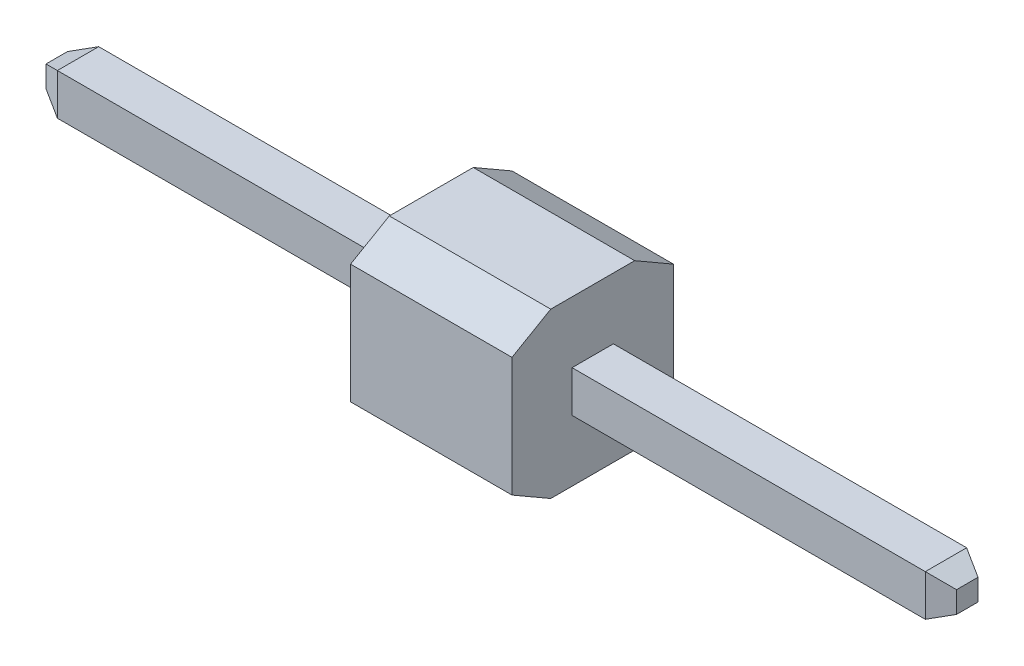
ISO-10303-21;
HEADER;
FILE_DESCRIPTION(('STEP AP214'),'2;1');
FILE_NAME('part.step','',(''),(''),'','','');
FILE_SCHEMA(('AUTOMOTIVE_DESIGN { 1 0 10303 214 1 1 1 1 }'));
ENDSEC;
DATA;
#1=APPLICATION_CONTEXT('core data for automotive mechanical design processes');
#2=APPLICATION_PROTOCOL_DEFINITION('international standard','automotive_design',2000,#1);
#3=PRODUCT_CONTEXT('',#1,'mechanical');
#4=PRODUCT('Part','Part','',(#3));
#5=PRODUCT_RELATED_PRODUCT_CATEGORY('part','',(#4));
#6=PRODUCT_DEFINITION_FORMATION('','',#4);
#7=PRODUCT_DEFINITION_CONTEXT('part definition',#1,'design');
#8=PRODUCT_DEFINITION('design','',#6,#7);
#9=PRODUCT_DEFINITION_SHAPE('','',#8);
#10=(LENGTH_UNIT() NAMED_UNIT(*) SI_UNIT(.MILLI.,.METRE.));
#11=(NAMED_UNIT(*) PLANE_ANGLE_UNIT() SI_UNIT($,.RADIAN.));
#12=(NAMED_UNIT(*) SI_UNIT($,.STERADIAN.) SOLID_ANGLE_UNIT());
#13=UNCERTAINTY_MEASURE_WITH_UNIT(LENGTH_MEASURE(1.E-05),#10,'distance_accuracy_value','');
#14=(GEOMETRIC_REPRESENTATION_CONTEXT(3) GLOBAL_UNCERTAINTY_ASSIGNED_CONTEXT((#13)) GLOBAL_UNIT_ASSIGNED_CONTEXT((#10,
#11,#12)) REPRESENTATION_CONTEXT('',''));
#15=CARTESIAN_POINT('',(0.,0.,0.));
#16=DIRECTION('',(0.,0.,1.));
#17=DIRECTION('',(1.,0.,0.));
#18=AXIS2_PLACEMENT_3D('',#15,#16,#17);
#19=CARTESIAN_POINT('',(5.42105048309456,-7.93712826291391,0.629998634255617));
#20=DIRECTION('',(1.,4.37113882867379E-08,-4.37113882867379E-08));
#21=DIRECTION('',(-4.37113882867379E-08,1.,0.));
#22=AXIS2_PLACEMENT_3D('',#19,#20,#21);
#23=PLANE('',#22);
#24=DIRECTION('',(1.59994777304463E-08,0.50000000000019,0.866025403784329));
#25=VECTOR('',#24,1.);
#26=CARTESIAN_POINT('',(5.42105036010864,-6.69353842442392,-0.940001365744382));
#27=LINE('',#26,#25);
#28=CARTESIAN_POINT('',(5.42105036010864,-6.69353842442392,-0.940001365744382));
#29=VERTEX_POINT('',#28);
#30=CARTESIAN_POINT('',(5.42105037119341,-6.34712826291392,-0.340001365744383));
#31=VERTEX_POINT('',#30);
#32=EDGE_CURVE('E11',#29,#31,#27,.T.);
#33=ORIENTED_EDGE('',*,*,#32,.T.);
#34=DIRECTION('',(4.37113886966664E-08,0.,0.999999999999999));
#35=VECTOR('',#34,1.);
#36=CARTESIAN_POINT('',(5.42105037119341,-6.34712826291392,-0.340001365744383));
#37=LINE('',#36,#35);
#38=CARTESIAN_POINT('',(5.42105042801821,-6.34712826291391,0.959998634255618));
#39=VERTEX_POINT('',#38);
#40=EDGE_CURVE('E304',#31,#39,#37,.T.);
#41=ORIENTED_EDGE('',*,*,#40,.T.);
#42=DIRECTION('',(5.97108668825761E-08,-0.500000000000186,0.86602540378433));
#43=VECTOR('',#42,1.);
#44=CARTESIAN_POINT('',(5.42105042801821,-6.34712826291391,0.959998634255618));
#45=LINE('',#44,#43);
#46=CARTESIAN_POINT('',(5.42105046938711,-6.69353842442391,1.55999863425562));
#47=VERTEX_POINT('',#46);
#48=EDGE_CURVE('E296',#39,#47,#45,.T.);
#49=ORIENTED_EDGE('',*,*,#48,.T.);
#50=DIRECTION('',(4.37113884815544E-08,-0.999999999999999,0.));
#51=VECTOR('',#50,1.);
#52=CARTESIAN_POINT('',(5.42105046938711,-6.69353842442391,1.55999863425562));
#53=LINE('',#52,#51);
#54=CARTESIAN_POINT('',(5.4210505501299,-8.54071810139391,1.55999863425562));
#55=VERTEX_POINT('',#54);
#56=EDGE_CURVE('E281',#47,#55,#53,.T.);
#57=ORIENTED_EDGE('',*,*,#56,.T.);
#58=DIRECTION('',(1.5999479012306E-08,0.500000000000192,0.866025403784328));
#59=VECTOR('',#58,1.);
#60=CARTESIAN_POINT('',(5.42105053904514,-8.88712826291391,0.959998634255618));
#61=LINE('',#60,#59);
#62=CARTESIAN_POINT('',(5.42105053904514,-8.88712826291391,0.959998634255618));
#63=VERTEX_POINT('',#62);
#64=EDGE_CURVE('E265',#63,#55,#61,.T.);
#65=ORIENTED_EDGE('',*,*,#64,.F.);
#66=DIRECTION('',(4.37113886966664E-08,0.,0.999999999999999));
#67=VECTOR('',#66,1.);
#68=CARTESIAN_POINT('',(5.42105048222033,-8.88712826291392,-0.340001365744383));
#69=LINE('',#68,#67);
#70=CARTESIAN_POINT('',(5.42105048222033,-8.88712826291392,-0.340001365744383));
#71=VERTEX_POINT('',#70);
#72=EDGE_CURVE('E248',#71,#63,#69,.T.);
#73=ORIENTED_EDGE('',*,*,#72,.F.);
#74=DIRECTION('',(5.97108656001701E-08,-0.500000000000187,0.866025403784328));
#75=VECTOR('',#74,1.);
#76=CARTESIAN_POINT('',(5.42105044085143,-8.54071810139392,-0.940001365744382));
#77=LINE('',#76,#75);
#78=CARTESIAN_POINT('',(5.42105044085143,-8.54071810139392,-0.940001365744382));
#79=VERTEX_POINT('',#78);
#80=EDGE_CURVE('E242',#79,#71,#77,.T.);
#81=ORIENTED_EDGE('',*,*,#80,.F.);
#82=DIRECTION('',(4.37113884815544E-08,-0.999999999999999,0.));
#83=VECTOR('',#82,1.);
#84=CARTESIAN_POINT('',(5.42105036010864,-6.69353842442392,-0.940001365744382));
#85=LINE('',#84,#83);
#86=EDGE_CURVE('E236',#29,#79,#85,.T.);
#87=ORIENTED_EDGE('',*,*,#86,.F.);
#88=EDGE_LOOP('',(#33,#41,#49,#57,#65,#73,#81,#87));
#89=FACE_BOUND('',#88,.T.);
#90=DIRECTION('',(-4.37113872875372E-08,0.,-0.999999999999999));
#91=VECTOR('',#90,1.);
#92=CARTESIAN_POINT('',(5.42105045511927,-7.29712826291391,0.629998634255617));
#93=LINE('',#92,#91);
#94=CARTESIAN_POINT('',(5.42105045511927,-7.29712826291391,0.629998634255617));
#95=VERTEX_POINT('',#94);
#96=CARTESIAN_POINT('',(5.42105042714398,-7.29712826291391,-0.0100013657443826));
#97=VERTEX_POINT('',#96);
#98=EDGE_CURVE('E302',#95,#97,#93,.T.);
#99=ORIENTED_EDGE('',*,*,#98,.T.);
#100=DIRECTION('',(-4.37113872875371E-08,0.999999999999999,0.));
#101=VECTOR('',#100,1.);
#102=CARTESIAN_POINT('',(5.42105045511927,-7.93712826291391,-0.0100013657443826));
#103=LINE('',#102,#101);
#104=CARTESIAN_POINT('',(5.42105045511927,-7.93712826291391,-0.0100013657443826));
#105=VERTEX_POINT('',#104);
#106=EDGE_CURVE('E293',#105,#97,#103,.T.);
#107=ORIENTED_EDGE('',*,*,#106,.F.);
#108=DIRECTION('',(-4.37113900630947E-08,0.,-0.999999999999999));
#109=VECTOR('',#108,1.);
#110=CARTESIAN_POINT('',(5.42105048309456,-7.93712826291391,0.629998634255617));
#111=LINE('',#110,#109);
#112=CARTESIAN_POINT('',(5.42105048309456,-7.93712826291391,0.629998634255617));
#113=VERTEX_POINT('',#112);
#114=EDGE_CURVE('E278',#113,#105,#111,.T.);
#115=ORIENTED_EDGE('',*,*,#114,.F.);
#116=DIRECTION('',(-4.37113900630947E-08,0.999999999999999,0.));
#117=VECTOR('',#116,1.);
#118=CARTESIAN_POINT('',(5.42105048309456,-7.93712826291391,0.629998634255617));
#119=LINE('',#118,#117);
#120=EDGE_CURVE('E263',#113,#95,#119,.T.);
#121=ORIENTED_EDGE('',*,*,#120,.T.);
#122=EDGE_LOOP('',(#99,#107,#115,#121));
#123=FACE_BOUND('',#122,.T.);
#124=ADVANCED_FACE('F17',(#89,#123),#23,.T.);
#125=CARTESIAN_POINT('',(2.92105048309456,-7.93712837219238,0.629998743534088));
#126=DIRECTION('',(1.,4.37113882867379E-08,-4.37113882867379E-08));
#127=DIRECTION('',(-4.37113882867379E-08,1.,0.));
#128=AXIS2_PLACEMENT_3D('',#125,#126,#127);
#129=PLANE('',#128);
#130=DIRECTION('',(1.59994783714339E-08,0.50000000000019,0.866025403784329));
#131=VECTOR('',#130,1.);
#132=CARTESIAN_POINT('',(2.92105036010864,-6.69353853370239,-0.940001256465912));
#133=LINE('',#132,#131);
#134=CARTESIAN_POINT('',(2.92105036010864,-6.69353853370239,-0.940001256465912));
#135=VERTEX_POINT('',#134);
#136=CARTESIAN_POINT('',(2.92105037119341,-6.34712837219239,-0.340001256465912));
#137=VERTEX_POINT('',#136);
#138=EDGE_CURVE('E24',#135,#137,#133,.T.);
#139=ORIENTED_EDGE('',*,*,#138,.F.);
#140=DIRECTION('',(4.37113882411396E-08,-0.999999999999999,0.));
#141=VECTOR('',#140,1.);
#142=CARTESIAN_POINT('',(2.92105036010864,-6.69353853370239,-0.940001256465912));
#143=LINE('',#142,#141);
#144=CARTESIAN_POINT('',(2.92105044085143,-8.54071821067239,-0.940001256465912));
#145=VERTEX_POINT('',#144);
#146=EDGE_CURVE('E300',#135,#145,#143,.T.);
#147=ORIENTED_EDGE('',*,*,#146,.T.);
#148=DIRECTION('',(5.97108668821452E-08,-0.500000000000187,0.866025403784328));
#149=VECTOR('',#148,1.);
#150=CARTESIAN_POINT('',(2.92105044085143,-8.54071821067239,-0.940001256465912));
#151=LINE('',#150,#149);
#152=CARTESIAN_POINT('',(2.92105048222033,-8.88712837219239,-0.340001256465912));
#153=VERTEX_POINT('',#152);
#154=EDGE_CURVE('E286',#145,#153,#151,.T.);
#155=ORIENTED_EDGE('',*,*,#154,.T.);
#156=DIRECTION('',(4.37113883550593E-08,0.,0.999999999999999));
#157=VECTOR('',#156,1.);
#158=CARTESIAN_POINT('',(2.92105048222033,-8.88712837219239,-0.340001256465912));
#159=LINE('',#158,#157);
#160=CARTESIAN_POINT('',(2.92105053904514,-8.88712837219238,0.959998743534088));
#161=VERTEX_POINT('',#160);
#162=EDGE_CURVE('E271',#153,#161,#159,.T.);
#163=ORIENTED_EDGE('',*,*,#162,.T.);
#164=DIRECTION('',(1.59994783713184E-08,0.500000000000192,0.866025403784328));
#165=VECTOR('',#164,1.);
#166=CARTESIAN_POINT('',(2.92105053904514,-8.88712837219238,0.959998743534088));
#167=LINE('',#166,#165);
#168=CARTESIAN_POINT('',(2.9210505501299,-8.54071821067238,1.55999874353409));
#169=VERTEX_POINT('',#168);
#170=EDGE_CURVE('E253',#161,#169,#167,.T.);
#171=ORIENTED_EDGE('',*,*,#170,.T.);
#172=DIRECTION('',(4.37113882411396E-08,-0.999999999999999,0.));
#173=VECTOR('',#172,1.);
#174=CARTESIAN_POINT('',(2.92105046938711,-6.69353853370238,1.55999874353409));
#175=LINE('',#174,#173);
#176=CARTESIAN_POINT('',(2.92105046938711,-6.69353853370238,1.55999874353409));
#177=VERTEX_POINT('',#176);
#178=EDGE_CURVE('E261',#177,#169,#175,.T.);
#179=ORIENTED_EDGE('',*,*,#178,.F.);
#180=DIRECTION('',(5.97108668825761E-08,-0.500000000000186,0.86602540378433));
#181=VECTOR('',#180,1.);
#182=CARTESIAN_POINT('',(2.92105042801821,-6.34712837219238,0.959998743534088));
#183=LINE('',#182,#181);
#184=CARTESIAN_POINT('',(2.92105042801821,-6.34712837219238,0.959998743534088));
#185=VERTEX_POINT('',#184);
#186=EDGE_CURVE('E276',#185,#177,#183,.T.);
#187=ORIENTED_EDGE('',*,*,#186,.F.);
#188=DIRECTION('',(4.37113883550593E-08,0.,0.999999999999999));
#189=VECTOR('',#188,1.);
#190=CARTESIAN_POINT('',(2.92105037119341,-6.34712837219239,-0.340001256465912));
#191=LINE('',#190,#189);
#192=EDGE_CURVE('E291',#137,#185,#191,.T.);
#193=ORIENTED_EDGE('',*,*,#192,.F.);
#194=EDGE_LOOP('',(#139,#147,#155,#163,#171,#179,#187,#193));
#195=FACE_BOUND('',#194,.T.);
#196=DIRECTION('',(-4.37113879814265E-08,0.999999999999999,0.));
#197=VECTOR('',#196,1.);
#198=CARTESIAN_POINT('',(2.92105045511927,-7.93712837219238,-0.0100012564659119));
#199=LINE('',#198,#197);
#200=CARTESIAN_POINT('',(2.92105045511927,-7.93712837219238,-0.0100012564659119));
#201=VERTEX_POINT('',#200);
#202=CARTESIAN_POINT('',(2.92105042714398,-7.29712837219238,-0.0100012564659119));
#203=VERTEX_POINT('',#202);
#204=EDGE_CURVE('E298',#201,#203,#199,.T.);
#205=ORIENTED_EDGE('',*,*,#204,.T.);
#206=DIRECTION('',(-4.37113879814266E-08,0.,-0.999999999999999));
#207=VECTOR('',#206,1.);
#208=CARTESIAN_POINT('',(2.92105045511927,-7.29712837219238,0.629998743534088));
#209=LINE('',#208,#207);
#210=CARTESIAN_POINT('',(2.92105045511927,-7.29712837219238,0.629998743534088));
#211=VERTEX_POINT('',#210);
#212=EDGE_CURVE('E283',#211,#203,#209,.T.);
#213=ORIENTED_EDGE('',*,*,#212,.F.);
#214=DIRECTION('',(-4.37113886753159E-08,0.999999999999999,0.));
#215=VECTOR('',#214,1.);
#216=CARTESIAN_POINT('',(2.92105048309456,-7.93712837219238,0.629998743534088));
#217=LINE('',#216,#215);
#218=CARTESIAN_POINT('',(2.92105048309456,-7.93712837219238,0.629998743534088));
#219=VERTEX_POINT('',#218);
#220=EDGE_CURVE('E268',#219,#211,#217,.T.);
#221=ORIENTED_EDGE('',*,*,#220,.F.);
#222=DIRECTION('',(-4.37113886753159E-08,0.,-0.999999999999999));
#223=VECTOR('',#222,1.);
#224=CARTESIAN_POINT('',(2.92105048309456,-7.93712837219238,0.629998743534088));
#225=LINE('',#224,#223);
#226=EDGE_CURVE('E251',#219,#201,#225,.T.);
#227=ORIENTED_EDGE('',*,*,#226,.T.);
#228=EDGE_LOOP('',(#205,#213,#221,#227));
#229=FACE_BOUND('',#228,.T.);
#230=ADVANCED_FACE('F314',(#195,#229),#129,.F.);
#231=CARTESIAN_POINT('',(5.42105036010864,-6.69353842442392,-0.940001365744382));
#232=DIRECTION('',(5.97108668343731E-08,-0.866025403784328,0.50000000000019));
#233=DIRECTION('',(-1.59994785476185E-08,-0.500000000000192,-0.866025403784329));
#234=AXIS2_PLACEMENT_3D('',#231,#232,#233);
#235=PLANE('',#234);
#236=ORIENTED_EDGE('',*,*,#138,.T.);
#237=DIRECTION('',(-0.999999999999998,-4.37113897078233E-08,4.37113883755557E-08));
#238=VECTOR('',#237,1.);
#239=CARTESIAN_POINT('',(5.42105037119341,-6.34712826291392,-0.340001365744383));
#240=LINE('',#239,#238);
#241=EDGE_CURVE('E288',#31,#137,#240,.T.);
#242=ORIENTED_EDGE('',*,*,#241,.F.);
#243=ORIENTED_EDGE('',*,*,#32,.F.);
#244=DIRECTION('',(-0.999999999999998,-4.37113868656524E-08,4.37113881091022E-08));
#245=VECTOR('',#244,1.);
#246=CARTESIAN_POINT('',(5.42105036010864,-6.69353842442392,-0.940001365744382));
#247=LINE('',#246,#245);
#248=EDGE_CURVE('E256',#29,#135,#247,.T.);
#249=ORIENTED_EDGE('',*,*,#248,.T.);
#250=EDGE_LOOP('',(#236,#242,#243,#249));
#251=FACE_BOUND('',#250,.T.);
#252=ADVANCED_FACE('F306',(#251),#235,.F.);
#253=CARTESIAN_POINT('',(5.42105037119341,-6.34712826291392,-0.340001365744383));
#254=DIRECTION('',(4.37113882867379E-08,-1.,0.));
#255=DIRECTION('',(1.,4.37113882867379E-08,-4.37113882867379E-08));
#256=AXIS2_PLACEMENT_3D('',#253,#254,#255);
#257=PLANE('',#256);
#258=ORIENTED_EDGE('',*,*,#192,.T.);
#259=DIRECTION('',(-0.999999999999998,-4.37113897078233E-08,4.37113882867378E-08));
#260=VECTOR('',#259,1.);
#261=CARTESIAN_POINT('',(5.42105042801821,-6.34712826291391,0.959998634255618));
#262=LINE('',#261,#260);
#263=EDGE_CURVE('E273',#39,#185,#262,.T.);
#264=ORIENTED_EDGE('',*,*,#263,.F.);
#265=ORIENTED_EDGE('',*,*,#40,.F.);
#266=ORIENTED_EDGE('',*,*,#241,.T.);
#267=EDGE_LOOP('',(#258,#264,#265,#266));
#268=FACE_BOUND('',#267,.T.);
#269=ADVANCED_FACE('F311',(#268),#257,.F.);
#270=CARTESIAN_POINT('',(5.42105042801821,-6.34712826291391,0.959998634255618));
#271=DIRECTION('',(1.59994785476185E-08,-0.86602540378433,-0.50000000000019));
#272=DIRECTION('',(-5.97108668343731E-08,0.500000000000188,-0.866025403784329));
#273=AXIS2_PLACEMENT_3D('',#270,#271,#272);
#274=PLANE('',#273);
#275=ORIENTED_EDGE('',*,*,#186,.T.);
#276=DIRECTION('',(-0.999999999999998,-4.37113868656524E-08,4.37113882867378E-08));
#277=VECTOR('',#276,1.);
#278=CARTESIAN_POINT('',(5.42105046938711,-6.69353842442391,1.55999863425562));
#279=LINE('',#278,#277);
#280=EDGE_CURVE('E258',#47,#177,#279,.T.);
#281=ORIENTED_EDGE('',*,*,#280,.F.);
#282=ORIENTED_EDGE('',*,*,#48,.F.);
#283=ORIENTED_EDGE('',*,*,#263,.T.);
#284=EDGE_LOOP('',(#275,#281,#282,#283));
#285=FACE_BOUND('',#284,.T.);
#286=ADVANCED_FACE('F319',(#285),#274,.F.);
#287=CARTESIAN_POINT('',(5.42105046938711,-6.69353842442391,1.55999863425562));
#288=DIRECTION('',(-4.37113882867379E-08,0.,-1.));
#289=DIRECTION('',(-1.,-4.37113882867379E-08,4.37113882867379E-08));
#290=AXIS2_PLACEMENT_3D('',#287,#288,#289);
#291=PLANE('',#290);
#292=ORIENTED_EDGE('',*,*,#178,.T.);
#293=DIRECTION('',(-0.999999999999998,-4.37113868656524E-08,4.37113882867378E-08));
#294=VECTOR('',#293,1.);
#295=CARTESIAN_POINT('',(5.4210505501299,-8.54071810139391,1.55999863425562));
#296=LINE('',#295,#294);
#297=EDGE_CURVE('E245',#55,#169,#296,.T.);
#298=ORIENTED_EDGE('',*,*,#297,.F.);
#299=ORIENTED_EDGE('',*,*,#56,.F.);
#300=ORIENTED_EDGE('',*,*,#280,.T.);
#301=EDGE_LOOP('',(#292,#298,#299,#300));
#302=FACE_BOUND('',#301,.T.);
#303=ADVANCED_FACE('F326',(#302),#291,.F.);
#304=CARTESIAN_POINT('',(5.42105053904514,-8.88712826291391,0.959998634255618));
#305=DIRECTION('',(5.97108668343731E-08,-0.866025403784328,0.50000000000019));
#306=DIRECTION('',(-1.59994785476185E-08,-0.500000000000192,-0.866025403784329));
#307=AXIS2_PLACEMENT_3D('',#304,#305,#306);
#308=PLANE('',#307);
#309=ORIENTED_EDGE('',*,*,#170,.F.);
#310=DIRECTION('',(-0.999999999999998,-4.37113868656524E-08,4.37113882867378E-08));
#311=VECTOR('',#310,1.);
#312=CARTESIAN_POINT('',(5.42105053904514,-8.88712826291391,0.959998634255618));
#313=LINE('',#312,#311);
#314=EDGE_CURVE('E239',#63,#161,#313,.T.);
#315=ORIENTED_EDGE('',*,*,#314,.F.);
#316=ORIENTED_EDGE('',*,*,#64,.T.);
#317=ORIENTED_EDGE('',*,*,#297,.T.);
#318=EDGE_LOOP('',(#309,#315,#316,#317));
#319=FACE_BOUND('',#318,.T.);
#320=ADVANCED_FACE('F329',(#319),#308,.T.);
#321=CARTESIAN_POINT('',(5.42105048222033,-8.88712826291392,-0.340001365744383));
#322=DIRECTION('',(4.37113882867379E-08,-1.,0.));
#323=DIRECTION('',(1.,4.37113882867379E-08,-4.37113882867379E-08));
#324=AXIS2_PLACEMENT_3D('',#321,#322,#323);
#325=PLANE('',#324);
#326=ORIENTED_EDGE('',*,*,#162,.F.);
#327=DIRECTION('',(-0.999999999999998,-4.37113868656524E-08,4.37113883755557E-08));
#328=VECTOR('',#327,1.);
#329=CARTESIAN_POINT('',(5.42105048222033,-8.88712826291392,-0.340001365744383));
#330=LINE('',#329,#328);
#331=EDGE_CURVE('E233',#71,#153,#330,.T.);
#332=ORIENTED_EDGE('',*,*,#331,.F.);
#333=ORIENTED_EDGE('',*,*,#72,.T.);
#334=ORIENTED_EDGE('',*,*,#314,.T.);
#335=EDGE_LOOP('',(#326,#332,#333,#334));
#336=FACE_BOUND('',#335,.T.);
#337=ADVANCED_FACE('F333',(#336),#325,.T.);
#338=CARTESIAN_POINT('',(5.42105044085143,-8.54071810139392,-0.940001365744382));
#339=DIRECTION('',(1.59994785476185E-08,-0.86602540378433,-0.50000000000019));
#340=DIRECTION('',(-5.97108668343731E-08,0.500000000000188,-0.866025403784329));
#341=AXIS2_PLACEMENT_3D('',#338,#339,#340);
#342=PLANE('',#341);
#343=ORIENTED_EDGE('',*,*,#154,.F.);
#344=DIRECTION('',(-0.999999999999998,-4.37113868656524E-08,4.37113881091021E-08));
#345=VECTOR('',#344,1.);
#346=CARTESIAN_POINT('',(5.42105044085143,-8.54071810139392,-0.940001365744382));
#347=LINE('',#346,#345);
#348=EDGE_CURVE('E230',#79,#145,#347,.T.);
#349=ORIENTED_EDGE('',*,*,#348,.F.);
#350=ORIENTED_EDGE('',*,*,#80,.T.);
#351=ORIENTED_EDGE('',*,*,#331,.T.);
#352=EDGE_LOOP('',(#343,#349,#350,#351));
#353=FACE_BOUND('',#352,.T.);
#354=ADVANCED_FACE('F337',(#353),#342,.T.);
#355=CARTESIAN_POINT('',(5.42105036010864,-6.69353842442392,-0.940001365744382));
#356=DIRECTION('',(-4.37113882867379E-08,0.,-1.));
#357=DIRECTION('',(-4.37113882867379E-08,1.,0.));
#358=AXIS2_PLACEMENT_3D('',#355,#356,#357);
#359=PLANE('',#358);
#360=ORIENTED_EDGE('',*,*,#146,.F.);
#361=ORIENTED_EDGE('',*,*,#248,.F.);
#362=ORIENTED_EDGE('',*,*,#86,.T.);
#363=ORIENTED_EDGE('',*,*,#348,.T.);
#364=EDGE_LOOP('',(#360,#361,#362,#363));
#365=FACE_BOUND('',#364,.T.);
#366=ADVANCED_FACE('F339',(#365),#359,.T.);
#367=CARTESIAN_POINT('',(-2.87894951690544,-7.93712862571844,0.62999899706014));
#368=DIRECTION('',(-1.,-4.37113882867379E-08,4.37113882867379E-08));
#369=DIRECTION('',(4.37113882867379E-08,-1.,0.));
#370=AXIS2_PLACEMENT_3D('',#367,#368,#369);
#371=PLANE('',#370);
#372=DIRECTION('',(4.37113927490808E-08,-0.999999999999999,0.));
#373=VECTOR('',#372,1.);
#374=CARTESIAN_POINT('',(-2.87894955940327,-7.45101015290844,0.14388052425114));
#375=LINE('',#374,#373);
#376=CARTESIAN_POINT('',(-2.87894955940327,-7.45101015290844,0.14388052425114));
#377=VERTEX_POINT('',#376);
#378=CARTESIAN_POINT('',(-2.87894954488073,-7.78324709851844,0.14388052425114));
#379=VERTEX_POINT('',#378);
#380=EDGE_CURVE('E228',#377,#379,#375,.T.);
#381=ORIENTED_EDGE('',*,*,#380,.T.);
#382=DIRECTION('',(4.37113874013716E-08,0.,0.999999999999999));
#383=VECTOR('',#382,1.);
#384=CARTESIAN_POINT('',(-2.87894954488073,-7.78324709851844,0.14388052425114));
#385=LINE('',#384,#383);
#386=CARTESIAN_POINT('',(-2.87894953035819,-7.78324709851844,0.47611746986914));
#387=VERTEX_POINT('',#386);
#388=EDGE_CURVE('E223',#379,#387,#385,.T.);
#389=ORIENTED_EDGE('',*,*,#388,.T.);
#390=DIRECTION('',(-4.37113900757526E-08,0.999999999999999,0.));
#391=VECTOR('',#390,1.);
#392=CARTESIAN_POINT('',(-2.87894953035819,-7.78324709851844,0.47611746986914));
#393=LINE('',#392,#391);
#394=CARTESIAN_POINT('',(-2.87894954488073,-7.45101015290844,0.47611746986914));
#395=VERTEX_POINT('',#394);
#396=EDGE_CURVE('E215',#387,#395,#393,.T.);
#397=ORIENTED_EDGE('',*,*,#396,.T.);
#398=DIRECTION('',(-4.37113847280434E-08,0.,-0.999999999999999));
#399=VECTOR('',#398,1.);
#400=CARTESIAN_POINT('',(-2.87894954488073,-7.45101015290844,0.47611746986914));
#401=LINE('',#400,#399);
#402=EDGE_CURVE('E207',#395,#377,#401,.T.);
#403=ORIENTED_EDGE('',*,*,#402,.T.);
#404=EDGE_LOOP('',(#381,#389,#397,#403));
#405=FACE_BOUND('',#404,.T.);
#406=ADVANCED_FACE('F341',(#405),#371,.T.);
#407=CARTESIAN_POINT('',(-2.87894951690544,-7.93712862571844,0.62999899706014));
#408=DIRECTION('',(4.37113882867379E-08,-1.,0.));
#409=DIRECTION('',(-4.37113882867379E-08,0.,-1.));
#410=AXIS2_PLACEMENT_3D('',#407,#408,#409);
#411=PLANE('',#410);
#412=DIRECTION('',(0.999999999999998,4.37113894947904E-08,-4.37113882769955E-08));
#413=VECTOR('',#412,1.);
#414=CARTESIAN_POINT('',(-2.54894951690544,-7.93712861129368,0.629998982635382));
#415=LINE('',#414,#413);
#416=CARTESIAN_POINT('',(-2.54894951690544,-7.93712861129368,0.629998982635382));
#417=VERTEX_POINT('',#416);
#418=EDGE_CURVE('E225',#417,#219,#415,.T.);
#419=ORIENTED_EDGE('',*,*,#418,.F.);
#420=DIRECTION('',(-4.37113872875372E-08,0.,-0.999999999999999));
#421=VECTOR('',#420,1.);
#422=CARTESIAN_POINT('',(-2.54894951690544,-7.93712861129368,0.629998982635382));
#423=LINE('',#422,#421);
#424=CARTESIAN_POINT('',(-2.54894954488073,-7.93712861129368,-0.010001017364618));
#425=VERTEX_POINT('',#424);
#426=EDGE_CURVE('E217',#417,#425,#423,.T.);
#427=ORIENTED_EDGE('',*,*,#426,.T.);
#428=DIRECTION('',(0.999999999999998,4.37113894947904E-08,-4.37113882161058E-08));
#429=VECTOR('',#428,1.);
#430=CARTESIAN_POINT('',(-2.54894954488073,-7.93712861129368,-0.010001017364618));
#431=LINE('',#430,#429);
#432=EDGE_CURVE('E220',#425,#201,#431,.T.);
#433=ORIENTED_EDGE('',*,*,#432,.T.);
#434=ORIENTED_EDGE('',*,*,#226,.F.);
#435=EDGE_LOOP('',(#419,#427,#433,#434));
#436=FACE_BOUND('',#435,.T.);
#437=ADVANCED_FACE('F348',(#436),#411,.T.);
#438=CARTESIAN_POINT('',(-2.87894954488073,-7.93712862571844,-0.0100010029398598));
#439=DIRECTION('',(-4.37113882867379E-08,0.,-1.));
#440=DIRECTION('',(-1.,-4.37113882867379E-08,4.37113882867379E-08));
#441=AXIS2_PLACEMENT_3D('',#438,#439,#440);
#442=PLANE('',#441);
#443=ORIENTED_EDGE('',*,*,#432,.F.);
#444=DIRECTION('',(-4.37113886753159E-08,0.999999999999999,0.));
#445=VECTOR('',#444,1.);
#446=CARTESIAN_POINT('',(-2.54894954488073,-7.93712861129368,-0.010001017364618));
#447=LINE('',#446,#445);
#448=CARTESIAN_POINT('',(-2.54894957285602,-7.29712861129368,-0.010001017364618));
#449=VERTEX_POINT('',#448);
#450=EDGE_CURVE('E209',#425,#449,#447,.T.);
#451=ORIENTED_EDGE('',*,*,#450,.T.);
#452=DIRECTION('',(0.999999999999998,4.37113894947904E-08,-4.37113882161057E-08));
#453=VECTOR('',#452,1.);
#454=CARTESIAN_POINT('',(-2.54894957285602,-7.29712861129368,-0.010001017364618));
#455=LINE('',#454,#453);
#456=EDGE_CURVE('E212',#449,#203,#455,.T.);
#457=ORIENTED_EDGE('',*,*,#456,.T.);
#458=ORIENTED_EDGE('',*,*,#204,.F.);
#459=EDGE_LOOP('',(#443,#451,#457,#458));
#460=FACE_BOUND('',#459,.T.);
#461=ADVANCED_FACE('F424',(#460),#442,.T.);
#462=CARTESIAN_POINT('',(-2.87894954488073,-7.29712862571844,0.62999899706014));
#463=DIRECTION('',(4.37113882867379E-08,-1.,0.));
#464=DIRECTION('',(-4.37113882867379E-08,0.,-1.));
#465=AXIS2_PLACEMENT_3D('',#462,#463,#464);
#466=PLANE('',#465);
#467=ORIENTED_EDGE('',*,*,#456,.F.);
#468=DIRECTION('',(4.37113900630947E-08,0.,0.999999999999999));
#469=VECTOR('',#468,1.);
#470=CARTESIAN_POINT('',(-2.54894957285602,-7.29712861129368,-0.010001017364618));
#471=LINE('',#470,#469);
#472=CARTESIAN_POINT('',(-2.54894954488073,-7.29712861129368,0.629998982635382));
#473=VERTEX_POINT('',#472);
#474=EDGE_CURVE('E201',#449,#473,#471,.T.);
#475=ORIENTED_EDGE('',*,*,#474,.T.);
#476=DIRECTION('',(0.999999999999998,4.37113894947904E-08,-4.37113882769955E-08));
#477=VECTOR('',#476,1.);
#478=CARTESIAN_POINT('',(-2.54894954488073,-7.29712861129368,0.629998982635382));
#479=LINE('',#478,#477);
#480=EDGE_CURVE('E204',#473,#211,#479,.T.);
#481=ORIENTED_EDGE('',*,*,#480,.T.);
#482=ORIENTED_EDGE('',*,*,#212,.T.);
#483=EDGE_LOOP('',(#467,#475,#481,#482));
#484=FACE_BOUND('',#483,.T.);
#485=ADVANCED_FACE('F421',(#484),#466,.F.);
#486=CARTESIAN_POINT('',(-2.87894951690544,-7.93712862571844,0.62999899706014));
#487=DIRECTION('',(-4.37113882867379E-08,0.,-1.));
#488=DIRECTION('',(-1.,-4.37113882867379E-08,4.37113882867379E-08));
#489=AXIS2_PLACEMENT_3D('',#486,#487,#488);
#490=PLANE('',#489);
#491=ORIENTED_EDGE('',*,*,#480,.F.);
#492=DIRECTION('',(4.37113858997583E-08,-0.999999999999999,0.));
#493=VECTOR('',#492,1.);
#494=CARTESIAN_POINT('',(-2.54894954488073,-7.29712861129368,0.629998982635382));
#495=LINE('',#494,#493);
#496=EDGE_CURVE('E196',#473,#417,#495,.T.);
#497=ORIENTED_EDGE('',*,*,#496,.T.);
#498=ORIENTED_EDGE('',*,*,#418,.T.);
#499=ORIENTED_EDGE('',*,*,#220,.T.);
#500=EDGE_LOOP('',(#491,#497,#498,#499));
#501=FACE_BOUND('',#500,.T.);
#502=ADVANCED_FACE('F376',(#501),#490,.F.);
#503=CARTESIAN_POINT('',(-2.87894951690544,-7.93712862571844,0.62999899706014));
#504=DIRECTION('',(-4.37113882867379E-08,0.,-1.));
#505=DIRECTION('',(-1.,-4.37113882867379E-08,4.37113882867379E-08));
#506=AXIS2_PLACEMENT_3D('',#503,#504,#505);
#507=PLANE('',#506);
#508=DIRECTION('',(0.999999999999998,4.37113881958092E-08,-4.37113882769955E-08));
#509=VECTOR('',#508,1.);
#510=CARTESIAN_POINT('',(5.42105048309456,-7.93712826291391,0.629998634255617));
#511=LINE('',#510,#509);
#512=CARTESIAN_POINT('',(10.8910504830946,-7.93712802381262,0.629998395154324));
#513=VERTEX_POINT('',#512);
#514=EDGE_CURVE('E199',#113,#513,#511,.T.);
#515=ORIENTED_EDGE('',*,*,#514,.T.);
#516=DIRECTION('',(-4.37113900630947E-08,0.999999999999999,0.));
#517=VECTOR('',#516,1.);
#518=CARTESIAN_POINT('',(10.8910504830946,-7.93712802381262,0.629998395154324));
#519=LINE('',#518,#517);
#520=CARTESIAN_POINT('',(10.8910504551193,-7.29712802381262,0.629998395154324));
#521=VERTEX_POINT('',#520);
#522=EDGE_CURVE('E191',#513,#521,#519,.T.);
#523=ORIENTED_EDGE('',*,*,#522,.T.);
#524=DIRECTION('',(0.999999999999998,4.37113829998842E-08,-4.37113882769955E-08));
#525=VECTOR('',#524,1.);
#526=CARTESIAN_POINT('',(5.42105045511927,-7.29712826291392,0.629998634255617));
#527=LINE('',#526,#525);
#528=EDGE_CURVE('E194',#95,#521,#527,.T.);
#529=ORIENTED_EDGE('',*,*,#528,.F.);
#530=ORIENTED_EDGE('',*,*,#120,.F.);
#531=EDGE_LOOP('',(#515,#523,#529,#530));
#532=FACE_BOUND('',#531,.T.);
#533=ADVANCED_FACE('F367',(#532),#507,.F.);
#534=CARTESIAN_POINT('',(-2.87894954488073,-7.29712862571844,0.62999899706014));
#535=DIRECTION('',(4.37113882867379E-08,-1.,0.));
#536=DIRECTION('',(-4.37113882867379E-08,0.,-1.));
#537=AXIS2_PLACEMENT_3D('',#534,#535,#536);
#538=PLANE('',#537);
#539=ORIENTED_EDGE('',*,*,#528,.T.);
#540=DIRECTION('',(-4.37113900630947E-08,0.,-0.999999999999999));
#541=VECTOR('',#540,1.);
#542=CARTESIAN_POINT('',(10.8910504551193,-7.29712802381262,0.629998395154324));
#543=LINE('',#542,#541);
#544=CARTESIAN_POINT('',(10.891050427144,-7.29712802381262,-0.0100016048456765));
#545=VERTEX_POINT('',#544);
#546=EDGE_CURVE('E186',#521,#545,#543,.T.);
#547=ORIENTED_EDGE('',*,*,#546,.T.);
#548=DIRECTION('',(0.999999999999998,4.37113829998842E-08,-4.37113881146228E-08));
#549=VECTOR('',#548,1.);
#550=CARTESIAN_POINT('',(5.42105042714398,-7.29712826291392,-0.0100013657443823));
#551=LINE('',#550,#549);
#552=EDGE_CURVE('E189',#97,#545,#551,.T.);
#553=ORIENTED_EDGE('',*,*,#552,.F.);
#554=ORIENTED_EDGE('',*,*,#98,.F.);
#555=EDGE_LOOP('',(#539,#547,#553,#554));
#556=FACE_BOUND('',#555,.T.);
#557=ADVANCED_FACE('F364',(#556),#538,.F.);
#558=CARTESIAN_POINT('',(-2.87894954488073,-7.93712862571844,-0.0100010029398598));
#559=DIRECTION('',(-4.37113882867379E-08,0.,-1.));
#560=DIRECTION('',(-1.,-4.37113882867379E-08,4.37113882867379E-08));
#561=AXIS2_PLACEMENT_3D('',#558,#559,#560);
#562=PLANE('',#561);
#563=ORIENTED_EDGE('',*,*,#552,.T.);
#564=DIRECTION('',(4.37113872875371E-08,-0.999999999999999,0.));
#565=VECTOR('',#564,1.);
#566=CARTESIAN_POINT('',(10.891050427144,-7.29712802381262,-0.0100016048456764));
#567=LINE('',#566,#565);
#568=CARTESIAN_POINT('',(10.8910504551193,-7.93712802381262,-0.0100016048456765));
#569=VERTEX_POINT('',#568);
#570=EDGE_CURVE('E176',#545,#569,#567,.T.);
#571=ORIENTED_EDGE('',*,*,#570,.T.);
#572=DIRECTION('',(0.999999999999998,4.37113881958092E-08,-4.37113881146228E-08));
#573=VECTOR('',#572,1.);
#574=CARTESIAN_POINT('',(5.42105045511927,-7.93712826291391,-0.0100013657443823));
#575=LINE('',#574,#573);
#576=EDGE_CURVE('E179',#105,#569,#575,.T.);
#577=ORIENTED_EDGE('',*,*,#576,.F.);
#578=ORIENTED_EDGE('',*,*,#106,.T.);
#579=EDGE_LOOP('',(#563,#571,#577,#578));
#580=FACE_BOUND('',#579,.T.);
#581=ADVANCED_FACE('F366',(#580),#562,.T.);
#582=CARTESIAN_POINT('',(-2.87894951690544,-7.93712862571844,0.62999899706014));
#583=DIRECTION('',(4.37113882867379E-08,-1.,0.));
#584=DIRECTION('',(-4.37113882867379E-08,0.,-1.));
#585=AXIS2_PLACEMENT_3D('',#582,#583,#584);
#586=PLANE('',#585);
#587=ORIENTED_EDGE('',*,*,#576,.T.);
#588=DIRECTION('',(4.37113845119796E-08,0.,0.999999999999999));
#589=VECTOR('',#588,1.);
#590=CARTESIAN_POINT('',(10.8910504551193,-7.93712802381262,-0.0100016048456765));
#591=LINE('',#590,#589);
#592=EDGE_CURVE('E167',#569,#513,#591,.T.);
#593=ORIENTED_EDGE('',*,*,#592,.T.);
#594=ORIENTED_EDGE('',*,*,#514,.F.);
#595=ORIENTED_EDGE('',*,*,#114,.T.);
#596=EDGE_LOOP('',(#587,#593,#594,#595));
#597=FACE_BOUND('',#596,.T.);
#598=ADVANCED_FACE('F373',(#597),#586,.T.);
#599=CARTESIAN_POINT('',(11.2210504830946,-7.93712800938786,0.629998380729565));
#600=DIRECTION('',(-1.,-4.37113882867379E-08,4.37113882867379E-08));
#601=DIRECTION('',(4.37113882867379E-08,-1.,0.));
#602=AXIS2_PLACEMENT_3D('',#599,#600,#601);
#603=PLANE('',#602);
#604=DIRECTION('',(-4.37113874024243E-08,0.999999999999999,0.));
#605=VECTOR('',#604,1.);
#606=CARTESIAN_POINT('',(11.2210504551193,-7.78324648218786,0.143879907920565));
#607=LINE('',#606,#605);
#608=CARTESIAN_POINT('',(11.2210504551193,-7.78324648218786,0.143879907920565));
#609=VERTEX_POINT('',#608);
#610=CARTESIAN_POINT('',(11.2210504405967,-7.45100953657786,0.143879907920565));
#611=VERTEX_POINT('',#610);
#612=EDGE_CURVE('E153',#609,#611,#607,.T.);
#613=ORIENTED_EDGE('',*,*,#612,.T.);
#614=DIRECTION('',(4.37113874013716E-08,0.,0.999999999999999));
#615=VECTOR('',#614,1.);
#616=CARTESIAN_POINT('',(11.2210504405967,-7.45100953657786,0.143879907920565));
#617=LINE('',#616,#615);
#618=CARTESIAN_POINT('',(11.2210504551193,-7.45100953657786,0.476116853538565));
#619=VERTEX_POINT('',#618);
#620=EDGE_CURVE('E395',#611,#619,#617,.T.);
#621=ORIENTED_EDGE('',*,*,#620,.T.);
#622=DIRECTION('',(4.37113874024243E-08,-0.999999999999999,0.));
#623=VECTOR('',#622,1.);
#624=CARTESIAN_POINT('',(11.2210504551193,-7.45100953657786,0.476116853538565));
#625=LINE('',#624,#623);
#626=CARTESIAN_POINT('',(11.2210504696418,-7.78324648218786,0.476116853538565));
#627=VERTEX_POINT('',#626);
#628=EDGE_CURVE('E156',#619,#627,#625,.T.);
#629=ORIENTED_EDGE('',*,*,#628,.T.);
#630=DIRECTION('',(-4.37113927480282E-08,0.,-0.999999999999999));
#631=VECTOR('',#630,1.);
#632=CARTESIAN_POINT('',(11.2210504696418,-7.78324648218786,0.476116853538565));
#633=LINE('',#632,#631);
#634=EDGE_CURVE('E149',#627,#609,#633,.T.);
#635=ORIENTED_EDGE('',*,*,#634,.T.);
#636=EDGE_LOOP('',(#613,#621,#629,#635));
#637=FACE_BOUND('',#636,.T.);
#638=ADVANCED_FACE('F151',(#637),#603,.F.);
#639=CARTESIAN_POINT('',(-2.87894953815435,-7.45101015290844,0.62999899706014));
#640=DIRECTION('',(-0.422618301356784,0.906307768563367,1.84732310895534E-08));
#641=DIRECTION('',(4.37113882867379E-08,0.,1.));
#642=AXIS2_PLACEMENT_3D('',#639,#640,#641);
#643=PLANE('',#642);
#644=DIRECTION('',(0.834817095446925,0.38928165712602,-0.389281657126018));
#645=VECTOR('',#644,1.);
#646=CARTESIAN_POINT('',(-2.87894955940328,-7.45101015290792,0.143880524251623));
#647=LINE('',#646,#645);
#648=EDGE_CURVE('E181',#377,#449,#647,.T.);
#649=ORIENTED_EDGE('',*,*,#648,.F.);
#650=ORIENTED_EDGE('',*,*,#402,.F.);
#651=DIRECTION('',(-0.834817129479007,-0.389281657126019,-0.389281584143986));
#652=VECTOR('',#651,1.);
#653=CARTESIAN_POINT('',(-2.54894954488116,-7.29712861129221,0.629998982634844));
#654=LINE('',#653,#652);
#655=EDGE_CURVE('E404',#473,#395,#654,.T.);
#656=ORIENTED_EDGE('',*,*,#655,.F.);
#657=ORIENTED_EDGE('',*,*,#474,.F.);
#658=EDGE_LOOP('',(#649,#650,#656,#657));
#659=FACE_BOUND('',#658,.T.);
#660=ADVANCED_FACE('F418',(#659),#643,.T.);
#661=CARTESIAN_POINT('',(-2.87894952363181,-7.93712862571844,0.47611746986914));
#662=DIRECTION('',(-0.422618222124841,-1.84732292043498E-08,0.906307805509828));
#663=DIRECTION('',(4.37113882867379E-08,-1.,0.));
#664=AXIS2_PLACEMENT_3D('',#661,#662,#663);
#665=PLANE('',#664);
#666=ORIENTED_EDGE('',*,*,#655,.T.);
#667=ORIENTED_EDGE('',*,*,#396,.F.);
#668=DIRECTION('',(-0.834817163511087,0.389281584143985,-0.389281584143987));
#669=VECTOR('',#668,1.);
#670=CARTESIAN_POINT('',(-2.54894951690429,-7.93712861129095,0.629998982635654));
#671=LINE('',#670,#669);
#672=EDGE_CURVE('E160',#417,#387,#671,.T.);
#673=ORIENTED_EDGE('',*,*,#672,.F.);
#674=ORIENTED_EDGE('',*,*,#496,.F.);
#675=EDGE_LOOP('',(#666,#667,#673,#674));
#676=FACE_BOUND('',#675,.T.);
#677=ADVANCED_FACE('F434',(#676),#665,.T.);
#678=CARTESIAN_POINT('',(-2.54894954488073,-7.93712861129368,-0.010001017364618));
#679=DIRECTION('',(0.422618301356784,1.8473232667688E-08,0.906307768563367));
#680=DIRECTION('',(-4.37113882867379E-08,1.,0.));
#681=AXIS2_PLACEMENT_3D('',#678,#679,#680);
#682=PLANE('',#681);
#683=ORIENTED_EDGE('',*,*,#648,.T.);
#684=ORIENTED_EDGE('',*,*,#450,.F.);
#685=DIRECTION('',(0.834817129479008,-0.389281584143985,-0.389281657126018));
#686=VECTOR('',#685,1.);
#687=CARTESIAN_POINT('',(-2.87894954488356,-7.78324709852598,0.1438805242526));
#688=LINE('',#687,#686);
#689=EDGE_CURVE('E170',#379,#425,#688,.T.);
#690=ORIENTED_EDGE('',*,*,#689,.F.);
#691=ORIENTED_EDGE('',*,*,#380,.F.);
#692=EDGE_LOOP('',(#683,#684,#690,#691));
#693=FACE_BOUND('',#692,.T.);
#694=ADVANCED_FACE('F413',(#693),#682,.F.);
#695=CARTESIAN_POINT('',(-2.54894951690544,-7.93712861129368,0.629998982635382));
#696=DIRECTION('',(0.422618222124841,0.906307805509828,-1.84732308250282E-08));
#697=DIRECTION('',(-4.37113882867379E-08,0.,-1.));
#698=AXIS2_PLACEMENT_3D('',#695,#696,#697);
#699=PLANE('',#698);
#700=ORIENTED_EDGE('',*,*,#672,.T.);
#701=ORIENTED_EDGE('',*,*,#388,.F.);
#702=ORIENTED_EDGE('',*,*,#689,.T.);
#703=ORIENTED_EDGE('',*,*,#426,.F.);
#704=EDGE_LOOP('',(#700,#701,#702,#703));
#705=FACE_BOUND('',#704,.T.);
#706=ADVANCED_FACE('F429',(#705),#699,.F.);
#707=CARTESIAN_POINT('',(11.2210504763682,-7.78324648218786,0.629998380729565));
#708=DIRECTION('',(0.422618301356784,-0.906307768563367,-1.84732310470096E-08));
#709=DIRECTION('',(4.37113882867379E-08,0.,1.));
#710=AXIS2_PLACEMENT_3D('',#707,#708,#709);
#711=PLANE('',#710);
#712=DIRECTION('',(-0.834817129479004,-0.389281657126025,-0.389281584143987));
#713=VECTOR('',#712,1.);
#714=CARTESIAN_POINT('',(11.2210504551193,-7.78324648218838,0.143879907921048));
#715=LINE('',#714,#713);
#716=EDGE_CURVE('E164',#609,#569,#715,.T.);
#717=ORIENTED_EDGE('',*,*,#716,.F.);
#718=ORIENTED_EDGE('',*,*,#634,.F.);
#719=DIRECTION('',(0.834817095446923,0.389281657126025,-0.389281657126018));
#720=VECTOR('',#719,1.);
#721=CARTESIAN_POINT('',(10.8910504830946,-7.93712802381262,0.629998395154324));
#722=LINE('',#721,#720);
#723=EDGE_CURVE('E392',#513,#627,#722,.T.);
#724=ORIENTED_EDGE('',*,*,#723,.F.);
#725=ORIENTED_EDGE('',*,*,#592,.F.);
#726=EDGE_LOOP('',(#717,#718,#724,#725));
#727=FACE_BOUND('',#726,.T.);
#728=ADVANCED_FACE('F165',(#727),#711,.T.);
#729=CARTESIAN_POINT('',(10.8910504830946,-7.93712802381262,0.629998395154324));
#730=DIRECTION('',(-0.422618301356784,-1.8473232667688E-08,-0.906307768563367));
#731=DIRECTION('',(-4.37113882867379E-08,1.,0.));
#732=AXIS2_PLACEMENT_3D('',#729,#730,#731);
#733=PLANE('',#732);
#734=ORIENTED_EDGE('',*,*,#723,.T.);
#735=ORIENTED_EDGE('',*,*,#628,.F.);
#736=DIRECTION('',(0.834817129479006,-0.389281584143989,-0.38928165712602));
#737=VECTOR('',#736,1.);
#738=CARTESIAN_POINT('',(10.8910504551208,-7.29712802380841,0.629998395153421));
#739=LINE('',#738,#737);
#740=EDGE_CURVE('E389',#521,#619,#739,.T.);
#741=ORIENTED_EDGE('',*,*,#740,.F.);
#742=ORIENTED_EDGE('',*,*,#522,.F.);
#743=EDGE_LOOP('',(#734,#735,#741,#742));
#744=FACE_BOUND('',#743,.T.);
#745=ADVANCED_FACE('F390',(#744),#733,.F.);
#746=CARTESIAN_POINT('',(11.2210504618456,-7.93712800938786,0.143879907920565));
#747=DIRECTION('',(0.422618222124841,1.84732292043498E-08,-0.906307805509828));
#748=DIRECTION('',(4.37113882867379E-08,-1.,0.));
#749=AXIS2_PLACEMENT_3D('',#746,#747,#748);
#750=PLANE('',#749);
#751=ORIENTED_EDGE('',*,*,#716,.T.);
#752=ORIENTED_EDGE('',*,*,#570,.F.);
#753=DIRECTION('',(-0.834817163511088,0.389281584143981,-0.389281584143989));
#754=VECTOR('',#753,1.);
#755=CARTESIAN_POINT('',(11.2210504405967,-7.45100953657734,0.143879907921048));
#756=LINE('',#755,#754);
#757=EDGE_CURVE('E175',#611,#545,#756,.T.);
#758=ORIENTED_EDGE('',*,*,#757,.F.);
#759=ORIENTED_EDGE('',*,*,#612,.F.);
#760=EDGE_LOOP('',(#751,#752,#758,#759));
#761=FACE_BOUND('',#760,.T.);
#762=ADVANCED_FACE('F173',(#761),#750,.T.);
#763=CARTESIAN_POINT('',(10.8910504551193,-7.29712802381262,0.629998395154324));
#764=DIRECTION('',(-0.422618222124841,-0.906307805509828,1.84732307824844E-08));
#765=DIRECTION('',(-4.37113882867379E-08,0.,-1.));
#766=AXIS2_PLACEMENT_3D('',#763,#764,#765);
#767=PLANE('',#766);
#768=ORIENTED_EDGE('',*,*,#740,.T.);
#769=ORIENTED_EDGE('',*,*,#620,.F.);
#770=ORIENTED_EDGE('',*,*,#757,.T.);
#771=ORIENTED_EDGE('',*,*,#546,.F.);
#772=EDGE_LOOP('',(#768,#769,#770,#771));
#773=FACE_BOUND('',#772,.T.);
#774=ADVANCED_FACE('F394',(#773),#767,.F.);
#775=CLOSED_SHELL('',(#124,#230,#252,#269,#286,#303,#320,#337,#354,#366,#406,#437,#461,#485,
#502,#533,#557,#581,#598,#638,#660,#677,#694,#706,#728,#745,#762,#774));
#776=MANIFOLD_SOLID_BREP('B1',#775);
#777=ADVANCED_BREP_SHAPE_REPRESENTATION('',(#18,#776),#14);
#778=SHAPE_DEFINITION_REPRESENTATION(#9,#777);
ENDSEC;
END-ISO-10303-21;
